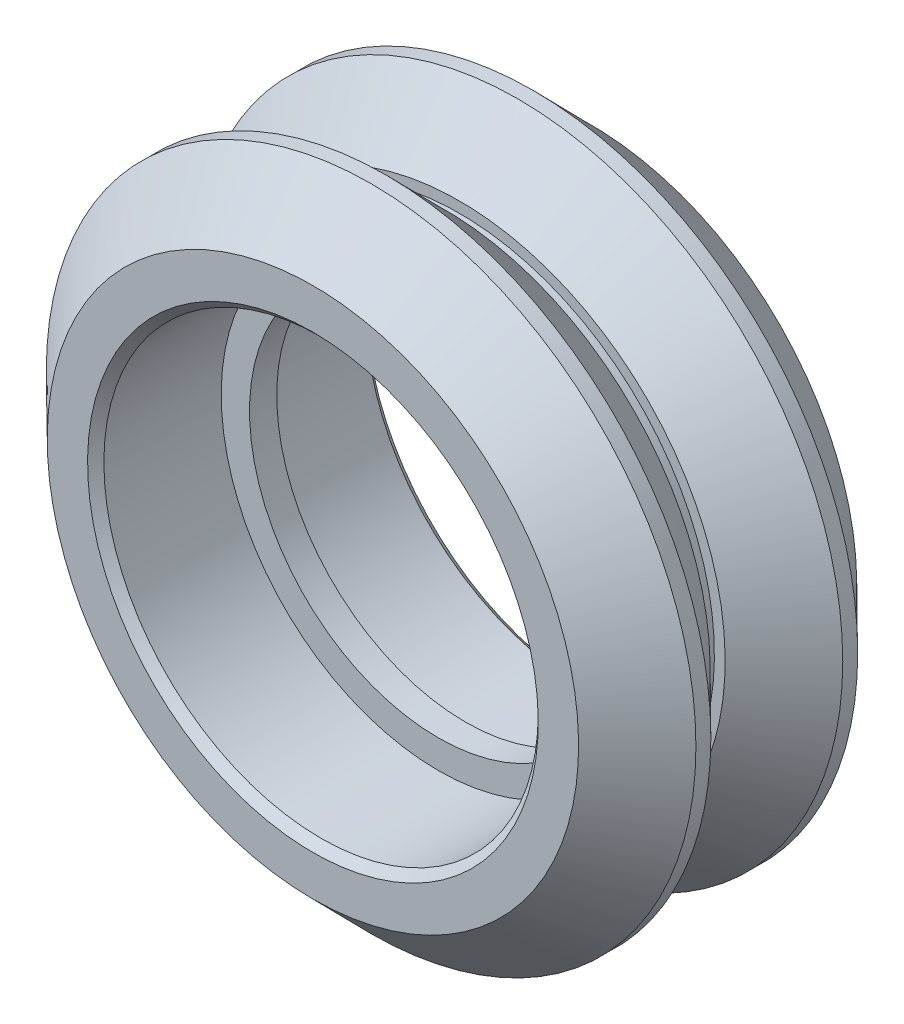
ISO-10303-21;
HEADER;
FILE_DESCRIPTION(('STEP AP214'),'2;1');
FILE_NAME('part.step','',(''),(''),'','','');
FILE_SCHEMA(('AUTOMOTIVE_DESIGN { 1 0 10303 214 1 1 1 1 }'));
ENDSEC;
DATA;
#1=APPLICATION_CONTEXT('core data for automotive mechanical design processes');
#2=APPLICATION_PROTOCOL_DEFINITION('international standard','automotive_design',2000,#1);
#3=PRODUCT_CONTEXT('',#1,'mechanical');
#4=PRODUCT('Part','Part','',(#3));
#5=PRODUCT_RELATED_PRODUCT_CATEGORY('part','',(#4));
#6=PRODUCT_DEFINITION_FORMATION('','',#4);
#7=PRODUCT_DEFINITION_CONTEXT('part definition',#1,'design');
#8=PRODUCT_DEFINITION('design','',#6,#7);
#9=PRODUCT_DEFINITION_SHAPE('','',#8);
#10=(LENGTH_UNIT() NAMED_UNIT(*) SI_UNIT(.MILLI.,.METRE.));
#11=(NAMED_UNIT(*) PLANE_ANGLE_UNIT() SI_UNIT($,.RADIAN.));
#12=(NAMED_UNIT(*) SI_UNIT($,.STERADIAN.) SOLID_ANGLE_UNIT());
#13=UNCERTAINTY_MEASURE_WITH_UNIT(LENGTH_MEASURE(1.E-05),#10,'distance_accuracy_value','');
#14=(GEOMETRIC_REPRESENTATION_CONTEXT(3) GLOBAL_UNCERTAINTY_ASSIGNED_CONTEXT((#13)) GLOBAL_UNIT_ASSIGNED_CONTEXT((#10,
#11,#12)) REPRESENTATION_CONTEXT('',''));
#15=CARTESIAN_POINT('',(0.,0.,0.));
#16=DIRECTION('',(0.,0.,1.));
#17=DIRECTION('',(1.,0.,0.));
#18=AXIS2_PLACEMENT_3D('',#15,#16,#17);
#19=CARTESIAN_POINT('',(0.,0.,5.115));
#20=DIRECTION('',(0.,0.,1.));
#21=DIRECTION('',(0.,-1.,0.));
#22=AXIS2_PLACEMENT_3D('',#19,#20,#21);
#23=CYLINDRICAL_SURFACE('',#22,7.987);
#24=CARTESIAN_POINT('',(0.,0.,4.815));
#25=DIRECTION('',(0.,0.,-1.));
#26=DIRECTION('',(0.,1.,0.));
#27=AXIS2_PLACEMENT_3D('',#24,#25,#26);
#28=CIRCLE('',#27,7.987);
#29=CARTESIAN_POINT('',(0.,7.987,4.815));
#30=VERTEX_POINT('',#29);
#31=EDGE_CURVE('E46',#30,#30,#28,.F.);
#32=ORIENTED_EDGE('',*,*,#31,.T.);
#33=EDGE_LOOP('',(#32));
#34=FACE_BOUND('',#33,.T.);
#35=CARTESIAN_POINT('',(0.,0.,0.499999999999998));
#36=DIRECTION('',(0.,0.,1.));
#37=DIRECTION('',(0.,-1.,0.));
#38=AXIS2_PLACEMENT_3D('',#35,#36,#37);
#39=CIRCLE('',#38,7.987);
#40=CARTESIAN_POINT('',(0.,-7.987,0.499999999999996));
#41=VERTEX_POINT('',#40);
#42=EDGE_CURVE('E90',#41,#41,#39,.T.);
#43=ORIENTED_EDGE('',*,*,#42,.F.);
#44=EDGE_LOOP('',(#43));
#45=FACE_BOUND('',#44,.T.);
#46=ADVANCED_FACE('F31',(#34,#45),#23,.F.);
#47=CARTESIAN_POINT('',(0.,9.77,5.115));
#48=DIRECTION('',(0.,0.,-1.));
#49=DIRECTION('',(0.,1.,0.));
#50=AXIS2_PLACEMENT_3D('',#47,#48,#49);
#51=PLANE('',#50);
#52=CARTESIAN_POINT('',(0.,0.,5.115));
#53=DIRECTION('',(0.,0.,-1.));
#54=DIRECTION('',(0.,1.,0.));
#55=AXIS2_PLACEMENT_3D('',#52,#53,#54);
#56=CIRCLE('',#55,8.287);
#57=CARTESIAN_POINT('',(0.,8.287,5.115));
#58=VERTEX_POINT('',#57);
#59=EDGE_CURVE('E42',#58,#58,#56,.T.);
#60=ORIENTED_EDGE('',*,*,#59,.T.);
#61=EDGE_LOOP('',(#60));
#62=FACE_BOUND('',#61,.T.);
#63=CARTESIAN_POINT('',(0.,0.,5.115));
#64=DIRECTION('',(0.,0.,1.));
#65=DIRECTION('',(0.,-1.,0.));
#66=AXIS2_PLACEMENT_3D('',#63,#64,#65);
#67=CIRCLE('',#66,9.77);
#68=CARTESIAN_POINT('',(0.,-9.77,5.115));
#69=VERTEX_POINT('',#68);
#70=EDGE_CURVE('E51',#69,#69,#67,.T.);
#71=ORIENTED_EDGE('',*,*,#70,.T.);
#72=EDGE_LOOP('',(#71));
#73=FACE_BOUND('',#72,.T.);
#74=ADVANCED_FACE('F97',(#62,#73),#51,.F.);
#75=CARTESIAN_POINT('',(0.,0.,2.975));
#76=DIRECTION('',(0.,0.,-1.));
#77=DIRECTION('',(0.,1.,0.));
#78=AXIS2_PLACEMENT_3D('',#75,#76,#77);
#79=CONICAL_SURFACE('',#78,11.945,0.79350922537995);
#80=ORIENTED_EDGE('',*,*,#70,.F.);
#81=EDGE_LOOP('',(#80));
#82=FACE_BOUND('',#81,.T.);
#83=CARTESIAN_POINT('',(0.,0.,2.975));
#84=DIRECTION('',(0.,0.,1.));
#85=DIRECTION('',(0.,-1.,0.));
#86=AXIS2_PLACEMENT_3D('',#83,#84,#85);
#87=CIRCLE('',#86,11.945);
#88=CARTESIAN_POINT('',(0.,-11.945,2.975));
#89=VERTEX_POINT('',#88);
#90=EDGE_CURVE('E54',#89,#89,#87,.T.);
#91=ORIENTED_EDGE('',*,*,#90,.T.);
#92=EDGE_LOOP('',(#91));
#93=FACE_BOUND('',#92,.T.);
#94=ADVANCED_FACE('F103',(#82,#93),#79,.T.);
#95=CARTESIAN_POINT('',(0.,0.,5.115));
#96=DIRECTION('',(0.,0.,1.));
#97=DIRECTION('',(0.,-1.,0.));
#98=AXIS2_PLACEMENT_3D('',#95,#96,#97);
#99=CYLINDRICAL_SURFACE('',#98,11.945);
#100=ORIENTED_EDGE('',*,*,#90,.F.);
#101=EDGE_LOOP('',(#100));
#102=FACE_BOUND('',#101,.T.);
#103=CARTESIAN_POINT('',(0.,0.,2.425));
#104=DIRECTION('',(0.,0.,1.));
#105=DIRECTION('',(0.,-1.,0.));
#106=AXIS2_PLACEMENT_3D('',#103,#104,#105);
#107=CIRCLE('',#106,11.945);
#108=CARTESIAN_POINT('',(0.,-11.945,2.425));
#109=VERTEX_POINT('',#108);
#110=EDGE_CURVE('E57',#109,#109,#107,.T.);
#111=ORIENTED_EDGE('',*,*,#110,.T.);
#112=EDGE_LOOP('',(#111));
#113=FACE_BOUND('',#112,.T.);
#114=ADVANCED_FACE('F126',(#102,#113),#99,.T.);
#115=CARTESIAN_POINT('',(0.,0.,0.274999999999998));
#116=DIRECTION('',(0.,0.,1.));
#117=DIRECTION('',(0.,-1.,0.));
#118=AXIS2_PLACEMENT_3D('',#115,#116,#117);
#119=CONICAL_SURFACE('',#118,9.77,0.791178445841111);
#120=ORIENTED_EDGE('',*,*,#110,.F.);
#121=EDGE_LOOP('',(#120));
#122=FACE_BOUND('',#121,.T.);
#123=CARTESIAN_POINT('',(0.,0.,0.274999999999998));
#124=DIRECTION('',(0.,0.,1.));
#125=DIRECTION('',(0.,-1.,0.));
#126=AXIS2_PLACEMENT_3D('',#123,#124,#125);
#127=CIRCLE('',#126,9.77);
#128=CARTESIAN_POINT('',(0.,-9.77,0.274999999999997));
#129=VERTEX_POINT('',#128);
#130=EDGE_CURVE('E60',#129,#129,#127,.T.);
#131=ORIENTED_EDGE('',*,*,#130,.T.);
#132=EDGE_LOOP('',(#131));
#133=FACE_BOUND('',#132,.T.);
#134=ADVANCED_FACE('F131',(#122,#133),#119,.T.);
#135=CARTESIAN_POINT('',(0.,9.77,0.275));
#136=DIRECTION('',(0.,0.,1.));
#137=DIRECTION('',(0.,-1.,0.));
#138=AXIS2_PLACEMENT_3D('',#135,#136,#137);
#139=PLANE('',#138);
#140=ORIENTED_EDGE('',*,*,#130,.F.);
#141=EDGE_LOOP('',(#140));
#142=FACE_BOUND('',#141,.T.);
#143=CARTESIAN_POINT('',(0.,0.,0.274999999999998));
#144=DIRECTION('',(0.,0.,1.));
#145=DIRECTION('',(0.,-1.,0.));
#146=AXIS2_PLACEMENT_3D('',#143,#144,#145);
#147=CIRCLE('',#146,9.375);
#148=CARTESIAN_POINT('',(0.,-9.375,0.274999999999997));
#149=VERTEX_POINT('',#148);
#150=EDGE_CURVE('E63',#149,#149,#147,.T.);
#151=ORIENTED_EDGE('',*,*,#150,.T.);
#152=EDGE_LOOP('',(#151));
#153=FACE_BOUND('',#152,.T.);
#154=ADVANCED_FACE('F137',(#142,#153),#139,.F.);
#155=CARTESIAN_POINT('',(0.,0.,5.115));
#156=DIRECTION('',(0.,0.,1.));
#157=DIRECTION('',(0.,-1.,0.));
#158=AXIS2_PLACEMENT_3D('',#155,#156,#157);
#159=CYLINDRICAL_SURFACE('',#158,9.375);
#160=ORIENTED_EDGE('',*,*,#150,.F.);
#161=EDGE_LOOP('',(#160));
#162=FACE_BOUND('',#161,.T.);
#163=CARTESIAN_POINT('',(0.,0.,-0.275000000000002));
#164=DIRECTION('',(0.,0.,1.));
#165=DIRECTION('',(0.,-1.,0.));
#166=AXIS2_PLACEMENT_3D('',#163,#164,#165);
#167=CIRCLE('',#166,9.375);
#168=CARTESIAN_POINT('',(0.,-9.375,-0.275000000000004));
#169=VERTEX_POINT('',#168);
#170=EDGE_CURVE('E66',#169,#169,#167,.T.);
#171=ORIENTED_EDGE('',*,*,#170,.T.);
#172=EDGE_LOOP('',(#171));
#173=FACE_BOUND('',#172,.T.);
#174=ADVANCED_FACE('F143',(#162,#173),#159,.T.);
#175=CARTESIAN_POINT('',(0.,9.77,-0.275));
#176=DIRECTION('',(0.,0.,-1.));
#177=DIRECTION('',(0.,1.,0.));
#178=AXIS2_PLACEMENT_3D('',#175,#176,#177);
#179=PLANE('',#178);
#180=ORIENTED_EDGE('',*,*,#170,.F.);
#181=EDGE_LOOP('',(#180));
#182=FACE_BOUND('',#181,.T.);
#183=CARTESIAN_POINT('',(0.,0.,-0.275000000000002));
#184=DIRECTION('',(0.,0.,1.));
#185=DIRECTION('',(0.,-1.,0.));
#186=AXIS2_PLACEMENT_3D('',#183,#184,#185);
#187=CIRCLE('',#186,9.77);
#188=CARTESIAN_POINT('',(0.,-9.77,-0.275000000000004));
#189=VERTEX_POINT('',#188);
#190=EDGE_CURVE('E69',#189,#189,#187,.T.);
#191=ORIENTED_EDGE('',*,*,#190,.T.);
#192=EDGE_LOOP('',(#191));
#193=FACE_BOUND('',#192,.T.);
#194=ADVANCED_FACE('F149',(#182,#193),#179,.F.);
#195=CARTESIAN_POINT('',(0.,0.,-2.425));
#196=DIRECTION('',(0.,0.,-1.));
#197=DIRECTION('',(0.,1.,0.));
#198=AXIS2_PLACEMENT_3D('',#195,#196,#197);
#199=CONICAL_SURFACE('',#198,11.945,0.791178445841111);
#200=ORIENTED_EDGE('',*,*,#190,.F.);
#201=EDGE_LOOP('',(#200));
#202=FACE_BOUND('',#201,.T.);
#203=CARTESIAN_POINT('',(0.,0.,-2.425));
#204=DIRECTION('',(0.,0.,1.));
#205=DIRECTION('',(0.,-1.,0.));
#206=AXIS2_PLACEMENT_3D('',#203,#204,#205);
#207=CIRCLE('',#206,11.945);
#208=CARTESIAN_POINT('',(0.,-11.945,-2.425));
#209=VERTEX_POINT('',#208);
#210=EDGE_CURVE('E72',#209,#209,#207,.T.);
#211=ORIENTED_EDGE('',*,*,#210,.T.);
#212=EDGE_LOOP('',(#211));
#213=FACE_BOUND('',#212,.T.);
#214=ADVANCED_FACE('F155',(#202,#213),#199,.T.);
#215=CARTESIAN_POINT('',(0.,0.,5.115));
#216=DIRECTION('',(0.,0.,1.));
#217=DIRECTION('',(0.,-1.,0.));
#218=AXIS2_PLACEMENT_3D('',#215,#216,#217);
#219=CYLINDRICAL_SURFACE('',#218,11.945);
#220=ORIENTED_EDGE('',*,*,#210,.F.);
#221=EDGE_LOOP('',(#220));
#222=FACE_BOUND('',#221,.T.);
#223=CARTESIAN_POINT('',(0.,0.,-2.975));
#224=DIRECTION('',(0.,0.,1.));
#225=DIRECTION('',(0.,-1.,0.));
#226=AXIS2_PLACEMENT_3D('',#223,#224,#225);
#227=CIRCLE('',#226,11.945);
#228=CARTESIAN_POINT('',(0.,-11.945,-2.975));
#229=VERTEX_POINT('',#228);
#230=EDGE_CURVE('E75',#229,#229,#227,.T.);
#231=ORIENTED_EDGE('',*,*,#230,.T.);
#232=EDGE_LOOP('',(#231));
#233=FACE_BOUND('',#232,.T.);
#234=ADVANCED_FACE('F161',(#222,#233),#219,.T.);
#235=CARTESIAN_POINT('',(0.,0.,-5.115));
#236=DIRECTION('',(0.,0.,1.));
#237=DIRECTION('',(0.,-1.,0.));
#238=AXIS2_PLACEMENT_3D('',#235,#236,#237);
#239=CONICAL_SURFACE('',#238,9.77,0.79350922537995);
#240=ORIENTED_EDGE('',*,*,#230,.F.);
#241=EDGE_LOOP('',(#240));
#242=FACE_BOUND('',#241,.T.);
#243=CARTESIAN_POINT('',(0.,0.,-5.115));
#244=DIRECTION('',(0.,0.,1.));
#245=DIRECTION('',(0.,-1.,0.));
#246=AXIS2_PLACEMENT_3D('',#243,#244,#245);
#247=CIRCLE('',#246,9.77);
#248=CARTESIAN_POINT('',(0.,-9.77,-5.115));
#249=VERTEX_POINT('',#248);
#250=EDGE_CURVE('E78',#249,#249,#247,.T.);
#251=ORIENTED_EDGE('',*,*,#250,.T.);
#252=EDGE_LOOP('',(#251));
#253=FACE_BOUND('',#252,.T.);
#254=ADVANCED_FACE('F167',(#242,#253),#239,.T.);
#255=CARTESIAN_POINT('',(0.,9.77,-5.115));
#256=DIRECTION('',(0.,0.,1.));
#257=DIRECTION('',(0.,-1.,0.));
#258=AXIS2_PLACEMENT_3D('',#255,#256,#257);
#259=PLANE('',#258);
#260=CARTESIAN_POINT('',(0.,0.,-5.115));
#261=DIRECTION('',(0.,0.,1.));
#262=DIRECTION('',(0.,-1.,0.));
#263=AXIS2_PLACEMENT_3D('',#260,#261,#262);
#264=CIRCLE('',#263,8.28700000000001);
#265=CARTESIAN_POINT('',(0.,-8.287,-5.115));
#266=VERTEX_POINT('',#265);
#267=EDGE_CURVE('E38',#266,#266,#264,.T.);
#268=ORIENTED_EDGE('',*,*,#267,.T.);
#269=EDGE_LOOP('',(#268));
#270=FACE_BOUND('',#269,.T.);
#271=ORIENTED_EDGE('',*,*,#250,.F.);
#272=EDGE_LOOP('',(#271));
#273=FACE_BOUND('',#272,.T.);
#274=ADVANCED_FACE('F173',(#270,#273),#259,.F.);
#275=CARTESIAN_POINT('',(0.,0.,5.115));
#276=DIRECTION('',(0.,0.,1.));
#277=DIRECTION('',(0.,-1.,0.));
#278=AXIS2_PLACEMENT_3D('',#275,#276,#277);
#279=CYLINDRICAL_SURFACE('',#278,7.987);
#280=CARTESIAN_POINT('',(0.,0.,-4.815));
#281=DIRECTION('',(0.,0.,1.));
#282=DIRECTION('',(0.,-1.,0.));
#283=AXIS2_PLACEMENT_3D('',#280,#281,#282);
#284=CIRCLE('',#283,7.987);
#285=CARTESIAN_POINT('',(0.,-7.987,-4.815));
#286=VERTEX_POINT('',#285);
#287=EDGE_CURVE('E10',#286,#286,#284,.F.);
#288=ORIENTED_EDGE('',*,*,#287,.T.);
#289=EDGE_LOOP('',(#288));
#290=FACE_BOUND('',#289,.T.);
#291=CARTESIAN_POINT('',(0.,0.,-0.500000000000001));
#292=DIRECTION('',(0.,0.,1.));
#293=DIRECTION('',(0.,-1.,0.));
#294=AXIS2_PLACEMENT_3D('',#291,#292,#293);
#295=CIRCLE('',#294,7.987);
#296=CARTESIAN_POINT('',(0.,-7.987,-0.500000000000003));
#297=VERTEX_POINT('',#296);
#298=EDGE_CURVE('E81',#297,#297,#295,.T.);
#299=ORIENTED_EDGE('',*,*,#298,.T.);
#300=EDGE_LOOP('',(#299));
#301=FACE_BOUND('',#300,.T.);
#302=ADVANCED_FACE('F178',(#290,#301),#279,.F.);
#303=CARTESIAN_POINT('',(0.,7.987,-0.5));
#304=DIRECTION('',(0.,0.,1.));
#305=DIRECTION('',(0.,-1.,0.));
#306=AXIS2_PLACEMENT_3D('',#303,#304,#305);
#307=PLANE('',#306);
#308=ORIENTED_EDGE('',*,*,#298,.F.);
#309=EDGE_LOOP('',(#308));
#310=FACE_BOUND('',#309,.T.);
#311=CARTESIAN_POINT('',(0.,0.,-0.500000000000002));
#312=DIRECTION('',(0.,0.,1.));
#313=DIRECTION('',(0.,-1.,0.));
#314=AXIS2_PLACEMENT_3D('',#311,#312,#313);
#315=CIRCLE('',#314,6.945);
#316=CARTESIAN_POINT('',(0.,-6.945,-0.500000000000003));
#317=VERTEX_POINT('',#316);
#318=EDGE_CURVE('E84',#317,#317,#315,.T.);
#319=ORIENTED_EDGE('',*,*,#318,.T.);
#320=EDGE_LOOP('',(#319));
#321=FACE_BOUND('',#320,.T.);
#322=ADVANCED_FACE('F183',(#310,#321),#307,.F.);
#323=CARTESIAN_POINT('',(0.,0.,5.115));
#324=DIRECTION('',(0.,0.,1.));
#325=DIRECTION('',(0.,-1.,0.));
#326=AXIS2_PLACEMENT_3D('',#323,#324,#325);
#327=CYLINDRICAL_SURFACE('',#326,6.945);
#328=ORIENTED_EDGE('',*,*,#318,.F.);
#329=EDGE_LOOP('',(#328));
#330=FACE_BOUND('',#329,.T.);
#331=CARTESIAN_POINT('',(0.,0.,0.499999999999999));
#332=DIRECTION('',(0.,0.,1.));
#333=DIRECTION('',(0.,-1.,0.));
#334=AXIS2_PLACEMENT_3D('',#331,#332,#333);
#335=CIRCLE('',#334,6.945);
#336=CARTESIAN_POINT('',(0.,-6.945,0.499999999999997));
#337=VERTEX_POINT('',#336);
#338=EDGE_CURVE('E87',#337,#337,#335,.T.);
#339=ORIENTED_EDGE('',*,*,#338,.T.);
#340=EDGE_LOOP('',(#339));
#341=FACE_BOUND('',#340,.T.);
#342=ADVANCED_FACE('F115',(#330,#341),#327,.F.);
#343=CARTESIAN_POINT('',(0.,7.987,0.5));
#344=DIRECTION('',(0.,0.,-1.));
#345=DIRECTION('',(0.,1.,0.));
#346=AXIS2_PLACEMENT_3D('',#343,#344,#345);
#347=PLANE('',#346);
#348=ORIENTED_EDGE('',*,*,#338,.F.);
#349=EDGE_LOOP('',(#348));
#350=FACE_BOUND('',#349,.T.);
#351=ORIENTED_EDGE('',*,*,#42,.T.);
#352=EDGE_LOOP('',(#351));
#353=FACE_BOUND('',#352,.T.);
#354=ADVANCED_FACE('F94',(#350,#353),#347,.F.);
#355=CARTESIAN_POINT('',(0.,0.,4.815));
#356=DIRECTION('',(0.,0.,1.));
#357=DIRECTION('',(0.,-1.,0.));
#358=AXIS2_PLACEMENT_3D('',#355,#356,#357);
#359=CONICAL_SURFACE('',#358,7.987,0.78539816339746);
#360=ORIENTED_EDGE('',*,*,#59,.F.);
#361=EDGE_LOOP('',(#360));
#362=FACE_BOUND('',#361,.T.);
#363=ORIENTED_EDGE('',*,*,#31,.F.);
#364=EDGE_LOOP('',(#363));
#365=FACE_BOUND('',#364,.T.);
#366=ADVANCED_FACE('F107',(#362,#365),#359,.F.);
#367=CARTESIAN_POINT('',(0.,0.,-5.115));
#368=DIRECTION('',(0.,0.,-1.));
#369=DIRECTION('',(0.,1.,0.));
#370=AXIS2_PLACEMENT_3D('',#367,#368,#369);
#371=CONICAL_SURFACE('',#370,8.28700000000001,0.785398163397448);
#372=ORIENTED_EDGE('',*,*,#287,.F.);
#373=EDGE_LOOP('',(#372));
#374=FACE_BOUND('',#373,.T.);
#375=ORIENTED_EDGE('',*,*,#267,.F.);
#376=EDGE_LOOP('',(#375));
#377=FACE_BOUND('',#376,.T.);
#378=ADVANCED_FACE('F33',(#374,#377),#371,.F.);
#379=CLOSED_SHELL('',(#46,#74,#94,#114,#134,#154,#174,#194,#214,#234,#254,#274,#302,#322,#342,
#354,#366,#378));
#380=MANIFOLD_SOLID_BREP('B2',#379);
#381=ADVANCED_BREP_SHAPE_REPRESENTATION('',(#18,#380),#14);
#382=SHAPE_DEFINITION_REPRESENTATION(#9,#381);
ENDSEC;
END-ISO-10303-21;
